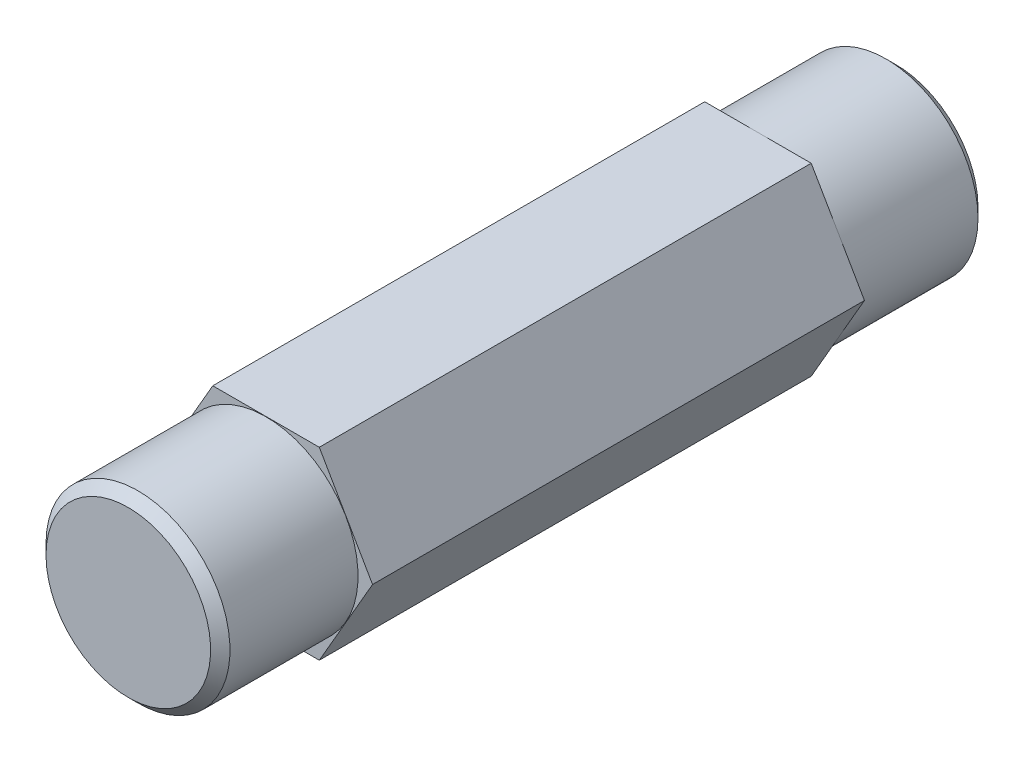
ISO-10303-21;
HEADER;
FILE_DESCRIPTION(('STEP AP214'),'2;1');
FILE_NAME('part.step','',(''),(''),'','','');
FILE_SCHEMA(('AUTOMOTIVE_DESIGN { 1 0 10303 214 1 1 1 1 }'));
ENDSEC;
DATA;
#1=APPLICATION_CONTEXT('core data for automotive mechanical design processes');
#2=APPLICATION_PROTOCOL_DEFINITION('international standard','automotive_design',2000,#1);
#3=PRODUCT_CONTEXT('',#1,'mechanical');
#4=PRODUCT('Part','Part','',(#3));
#5=PRODUCT_RELATED_PRODUCT_CATEGORY('part','',(#4));
#6=PRODUCT_DEFINITION_FORMATION('','',#4);
#7=PRODUCT_DEFINITION_CONTEXT('part definition',#1,'design');
#8=PRODUCT_DEFINITION('design','',#6,#7);
#9=PRODUCT_DEFINITION_SHAPE('','',#8);
#10=(LENGTH_UNIT() NAMED_UNIT(*) SI_UNIT(.MILLI.,.METRE.));
#11=(NAMED_UNIT(*) PLANE_ANGLE_UNIT() SI_UNIT($,.RADIAN.));
#12=(NAMED_UNIT(*) SI_UNIT($,.STERADIAN.) SOLID_ANGLE_UNIT());
#13=UNCERTAINTY_MEASURE_WITH_UNIT(LENGTH_MEASURE(1.E-05),#10,'distance_accuracy_value','');
#14=(GEOMETRIC_REPRESENTATION_CONTEXT(3) GLOBAL_UNCERTAINTY_ASSIGNED_CONTEXT((#13)) GLOBAL_UNIT_ASSIGNED_CONTEXT((#10,
#11,#12)) REPRESENTATION_CONTEXT('',''));
#15=CARTESIAN_POINT('',(0.,0.,0.));
#16=DIRECTION('',(0.,0.,1.));
#17=DIRECTION('',(1.,0.,0.));
#18=AXIS2_PLACEMENT_3D('',#15,#16,#17);
#19=CARTESIAN_POINT('',(0.,0.,19.812));
#20=DIRECTION('',(0.,0.,1.));
#21=DIRECTION('',(1.,0.,0.));
#22=AXIS2_PLACEMENT_3D('',#19,#20,#21);
#23=PLANE('',#22);
#24=CARTESIAN_POINT('',(0.,0.,19.8120000000017));
#25=DIRECTION('',(0.,0.,-1.));
#26=DIRECTION('',(-1.,0.,0.));
#27=AXIS2_PLACEMENT_3D('',#24,#25,#26);
#28=CIRCLE('',#27,4.24980000002506);
#29=CARTESIAN_POINT('',(-4.24980000002506,0.,19.8120000000017));
#30=VERTEX_POINT('',#29);
#31=EDGE_CURVE('E21',#30,#30,#28,.T.);
#32=ORIENTED_EDGE('',*,*,#31,.F.);
#33=EDGE_LOOP('',(#32));
#34=FACE_BOUND('',#33,.T.);
#35=ADVANCED_FACE('F18',(#34),#23,.T.);
#36=CARTESIAN_POINT('',(0.,0.,-19.812));
#37=DIRECTION('',(0.,0.,-1.));
#38=DIRECTION('',(-1.,0.,0.));
#39=AXIS2_PLACEMENT_3D('',#36,#37,#38);
#40=PLANE('',#39);
#41=CARTESIAN_POINT('',(0.,0.,-19.8120000000017));
#42=DIRECTION('',(0.,0.,1.));
#43=DIRECTION('',(1.,0.,0.));
#44=AXIS2_PLACEMENT_3D('',#41,#42,#43);
#45=CIRCLE('',#44,4.24980000002506);
#46=CARTESIAN_POINT('',(4.24980000002506,0.,-19.8120000000017));
#47=VERTEX_POINT('',#46);
#48=EDGE_CURVE('E107',#47,#47,#45,.T.);
#49=ORIENTED_EDGE('',*,*,#48,.F.);
#50=EDGE_LOOP('',(#49));
#51=FACE_BOUND('',#50,.T.);
#52=ADVANCED_FACE('F125',(#51),#40,.T.);
#53=CARTESIAN_POINT('',(0.,0.,19.3120000000135));
#54=DIRECTION('',(0.,0.,-1.));
#55=DIRECTION('',(-1.,0.,0.));
#56=AXIS2_PLACEMENT_3D('',#53,#54,#55);
#57=CONICAL_SURFACE('',#56,4.74980000007008,0.785398163454292);
#58=CARTESIAN_POINT('',(0.,0.,19.312));
#59=DIRECTION('',(0.,0.,-1.));
#60=DIRECTION('',(-1.,0.,0.));
#61=AXIS2_PLACEMENT_3D('',#58,#59,#60);
#62=CIRCLE('',#61,4.7498);
#63=CARTESIAN_POINT('',(-4.7498,0.,19.312));
#64=VERTEX_POINT('',#63);
#65=EDGE_CURVE('E104',#64,#64,#62,.T.);
#66=ORIENTED_EDGE('',*,*,#65,.F.);
#67=EDGE_LOOP('',(#66));
#68=FACE_BOUND('',#67,.T.);
#69=ORIENTED_EDGE('',*,*,#31,.T.);
#70=EDGE_LOOP('',(#69));
#71=FACE_BOUND('',#70,.T.);
#72=ADVANCED_FACE('F122',(#68,#71),#57,.T.);
#73=CARTESIAN_POINT('',(0.,0.,-19.3120000000704));
#74=DIRECTION('',(0.,0.,1.));
#75=DIRECTION('',(1.,0.,0.));
#76=AXIS2_PLACEMENT_3D('',#73,#74,#75);
#77=CONICAL_SURFACE('',#76,4.74979999995639,0.785398163397448);
#78=CARTESIAN_POINT('',(0.,0.,-19.312));
#79=DIRECTION('',(0.,0.,1.));
#80=DIRECTION('',(1.,0.,0.));
#81=AXIS2_PLACEMENT_3D('',#78,#79,#80);
#82=CIRCLE('',#81,4.7498);
#83=CARTESIAN_POINT('',(4.7498,0.,-19.312));
#84=VERTEX_POINT('',#83);
#85=EDGE_CURVE('E101',#84,#84,#82,.T.);
#86=ORIENTED_EDGE('',*,*,#85,.F.);
#87=EDGE_LOOP('',(#86));
#88=FACE_BOUND('',#87,.T.);
#89=ORIENTED_EDGE('',*,*,#48,.T.);
#90=EDGE_LOOP('',(#89));
#91=FACE_BOUND('',#90,.T.);
#92=ADVANCED_FACE('F166',(#88,#91),#77,.T.);
#93=CARTESIAN_POINT('',(0.,0.,19.812));
#94=DIRECTION('',(0.,0.,-1.));
#95=DIRECTION('',(-1.,0.,0.));
#96=AXIS2_PLACEMENT_3D('',#93,#94,#95);
#97=CYLINDRICAL_SURFACE('',#96,4.7498);
#98=CARTESIAN_POINT('',(0.,0.,12.7));
#99=DIRECTION('',(0.,0.,-1.));
#100=DIRECTION('',(-1.,0.,0.));
#101=AXIS2_PLACEMENT_3D('',#98,#99,#100);
#102=CIRCLE('',#101,4.7498);
#103=CARTESIAN_POINT('',(-4.7498,0.,12.7));
#104=VERTEX_POINT('',#103);
#105=EDGE_CURVE('E113',#104,#104,#102,.T.);
#106=ORIENTED_EDGE('',*,*,#105,.F.);
#107=EDGE_LOOP('',(#106));
#108=FACE_BOUND('',#107,.T.);
#109=ORIENTED_EDGE('',*,*,#65,.T.);
#110=EDGE_LOOP('',(#109));
#111=FACE_BOUND('',#110,.T.);
#112=ADVANCED_FACE('F162',(#108,#111),#97,.T.);
#113=CARTESIAN_POINT('',(0.,0.,-19.812));
#114=DIRECTION('',(0.,0.,1.));
#115=DIRECTION('',(1.,0.,0.));
#116=AXIS2_PLACEMENT_3D('',#113,#114,#115);
#117=CYLINDRICAL_SURFACE('',#116,4.7498);
#118=CARTESIAN_POINT('',(0.,0.,-12.7));
#119=DIRECTION('',(0.,0.,1.));
#120=DIRECTION('',(1.,0.,0.));
#121=AXIS2_PLACEMENT_3D('',#118,#119,#120);
#122=CIRCLE('',#121,4.7498);
#123=CARTESIAN_POINT('',(4.7498,0.,-12.7));
#124=VERTEX_POINT('',#123);
#125=EDGE_CURVE('E108',#124,#124,#122,.F.);
#126=ORIENTED_EDGE('',*,*,#125,.T.);
#127=EDGE_LOOP('',(#126));
#128=FACE_BOUND('',#127,.T.);
#129=ORIENTED_EDGE('',*,*,#85,.T.);
#130=EDGE_LOOP('',(#129));
#131=FACE_BOUND('',#130,.T.);
#132=ADVANCED_FACE('F159',(#128,#131),#117,.T.);
#133=CARTESIAN_POINT('',(5.49926131403118,0.,12.7));
#134=DIRECTION('',(-0.866025403784439,-0.5,0.));
#135=DIRECTION('',(0.5,-0.866025403784439,0.));
#136=AXIS2_PLACEMENT_3D('',#133,#134,#135);
#137=PLANE('',#136);
#138=DIRECTION('',(0.,0.,-1.));
#139=VECTOR('',#138,1.);
#140=CARTESIAN_POINT('',(2.74963065701559,4.7625,12.7));
#141=LINE('',#140,#139);
#142=CARTESIAN_POINT('',(2.74963065701559,4.7625,-12.7));
#143=VERTEX_POINT('',#142);
#144=CARTESIAN_POINT('',(2.74963065701559,4.7625,12.7));
#145=VERTEX_POINT('',#144);
#146=EDGE_CURVE('E83',#143,#145,#141,.F.);
#147=ORIENTED_EDGE('',*,*,#146,.T.);
#148=DIRECTION('',(-0.5,0.866025403784439,0.));
#149=VECTOR('',#148,1.);
#150=CARTESIAN_POINT('',(5.49926131403118,0.,12.7));
#151=LINE('',#150,#149);
#152=CARTESIAN_POINT('',(5.49926131403118,0.,12.7));
#153=VERTEX_POINT('',#152);
#154=EDGE_CURVE('E88',#153,#145,#151,.T.);
#155=ORIENTED_EDGE('',*,*,#154,.F.);
#156=DIRECTION('',(0.,0.,1.));
#157=VECTOR('',#156,1.);
#158=CARTESIAN_POINT('',(5.49926131403118,0.,12.7));
#159=LINE('',#158,#157);
#160=CARTESIAN_POINT('',(5.49926131403118,0.,-12.7));
#161=VERTEX_POINT('',#160);
#162=EDGE_CURVE('E74',#153,#161,#159,.F.);
#163=ORIENTED_EDGE('',*,*,#162,.T.);
#164=DIRECTION('',(-0.5,0.866025403784439,0.));
#165=VECTOR('',#164,1.);
#166=CARTESIAN_POINT('',(5.49926131403118,0.,-12.7));
#167=LINE('',#166,#165);
#168=EDGE_CURVE('E111',#161,#143,#167,.T.);
#169=ORIENTED_EDGE('',*,*,#168,.T.);
#170=EDGE_LOOP('',(#147,#155,#163,#169));
#171=FACE_BOUND('',#170,.T.);
#172=ADVANCED_FACE('F92',(#171),#137,.F.);
#173=CARTESIAN_POINT('',(-2.74963065701559,-4.7625,12.7));
#174=DIRECTION('',(0.,1.,0.));
#175=DIRECTION('',(0.,0.,1.));
#176=AXIS2_PLACEMENT_3D('',#173,#174,#175);
#177=PLANE('',#176);
#178=DIRECTION('',(0.,0.,1.));
#179=VECTOR('',#178,1.);
#180=CARTESIAN_POINT('',(2.74963065701559,-4.7625,12.7));
#181=LINE('',#180,#179);
#182=CARTESIAN_POINT('',(2.74963065701559,-4.7625,-12.7));
#183=VERTEX_POINT('',#182);
#184=CARTESIAN_POINT('',(2.74963065701559,-4.7625,12.7));
#185=VERTEX_POINT('',#184);
#186=EDGE_CURVE('E67',#183,#185,#181,.T.);
#187=ORIENTED_EDGE('',*,*,#186,.T.);
#188=DIRECTION('',(1.,0.,0.));
#189=VECTOR('',#188,1.);
#190=CARTESIAN_POINT('',(5.49926131403118,-4.7625,12.7));
#191=LINE('',#190,#189);
#192=CARTESIAN_POINT('',(-2.74963065701559,-4.7625,12.7));
#193=VERTEX_POINT('',#192);
#194=EDGE_CURVE('E90',#193,#185,#191,.T.);
#195=ORIENTED_EDGE('',*,*,#194,.F.);
#196=DIRECTION('',(0.,0.,1.));
#197=VECTOR('',#196,1.);
#198=CARTESIAN_POINT('',(-2.74963065701559,-4.7625,12.7));
#199=LINE('',#198,#197);
#200=CARTESIAN_POINT('',(-2.74963065701559,-4.7625,-12.7));
#201=VERTEX_POINT('',#200);
#202=EDGE_CURVE('E112',#193,#201,#199,.F.);
#203=ORIENTED_EDGE('',*,*,#202,.T.);
#204=DIRECTION('',(1.,0.,0.));
#205=VECTOR('',#204,1.);
#206=CARTESIAN_POINT('',(5.49926131403118,-4.7625,-12.7));
#207=LINE('',#206,#205);
#208=EDGE_CURVE('E250',#201,#183,#207,.T.);
#209=ORIENTED_EDGE('',*,*,#208,.T.);
#210=EDGE_LOOP('',(#187,#195,#203,#209));
#211=FACE_BOUND('',#210,.T.);
#212=ADVANCED_FACE('F154',(#211),#177,.F.);
#213=CARTESIAN_POINT('',(2.74963065701559,-4.7625,12.7));
#214=DIRECTION('',(-0.866025403784439,0.5,0.));
#215=DIRECTION('',(-0.5,-0.866025403784439,0.));
#216=AXIS2_PLACEMENT_3D('',#213,#214,#215);
#217=PLANE('',#216);
#218=ORIENTED_EDGE('',*,*,#162,.F.);
#219=DIRECTION('',(0.5,0.866025403784439,0.));
#220=VECTOR('',#219,1.);
#221=CARTESIAN_POINT('',(2.74963065701559,-4.7625,12.7));
#222=LINE('',#221,#220);
#223=EDGE_CURVE('E77',#185,#153,#222,.T.);
#224=ORIENTED_EDGE('',*,*,#223,.F.);
#225=ORIENTED_EDGE('',*,*,#186,.F.);
#226=DIRECTION('',(0.5,0.866025403784439,0.));
#227=VECTOR('',#226,1.);
#228=CARTESIAN_POINT('',(2.74963065701559,-4.7625,-12.7));
#229=LINE('',#228,#227);
#230=EDGE_CURVE('E79',#183,#161,#229,.T.);
#231=ORIENTED_EDGE('',*,*,#230,.T.);
#232=EDGE_LOOP('',(#218,#224,#225,#231));
#233=FACE_BOUND('',#232,.T.);
#234=ADVANCED_FACE('F76',(#233),#217,.F.);
#235=CARTESIAN_POINT('',(2.74963065701559,4.7625,12.7));
#236=DIRECTION('',(0.,-1.,0.));
#237=DIRECTION('',(0.,0.,-1.));
#238=AXIS2_PLACEMENT_3D('',#235,#236,#237);
#239=PLANE('',#238);
#240=DIRECTION('',(0.,0.,1.));
#241=VECTOR('',#240,1.);
#242=CARTESIAN_POINT('',(-2.74963065701559,4.7625,12.7));
#243=LINE('',#242,#241);
#244=CARTESIAN_POINT('',(-2.74963065701559,4.7625,-12.7));
#245=VERTEX_POINT('',#244);
#246=CARTESIAN_POINT('',(-2.74963065701559,4.7625,12.7));
#247=VERTEX_POINT('',#246);
#248=EDGE_CURVE('E242',#245,#247,#243,.T.);
#249=ORIENTED_EDGE('',*,*,#248,.T.);
#250=DIRECTION('',(1.,0.,0.));
#251=VECTOR('',#250,1.);
#252=CARTESIAN_POINT('',(5.49926131403118,4.7625,12.7));
#253=LINE('',#252,#251);
#254=EDGE_CURVE('E94',#145,#247,#253,.F.);
#255=ORIENTED_EDGE('',*,*,#254,.F.);
#256=ORIENTED_EDGE('',*,*,#146,.F.);
#257=DIRECTION('',(1.,0.,0.));
#258=VECTOR('',#257,1.);
#259=CARTESIAN_POINT('',(5.49926131403118,4.7625,-12.7));
#260=LINE('',#259,#258);
#261=EDGE_CURVE('E244',#143,#245,#260,.F.);
#262=ORIENTED_EDGE('',*,*,#261,.T.);
#263=EDGE_LOOP('',(#249,#255,#256,#262));
#264=FACE_BOUND('',#263,.T.);
#265=ADVANCED_FACE('F147',(#264),#239,.F.);
#266=CARTESIAN_POINT('',(5.49926131403118,0.,12.7));
#267=DIRECTION('',(0.,0.,1.));
#268=DIRECTION('',(1.,0.,0.));
#269=AXIS2_PLACEMENT_3D('',#266,#267,#268);
#270=PLANE('',#269);
#271=ORIENTED_EDGE('',*,*,#105,.T.);
#272=EDGE_LOOP('',(#271));
#273=FACE_BOUND('',#272,.T.);
#274=DIRECTION('',(-0.5,0.866025403784439,0.));
#275=VECTOR('',#274,1.);
#276=CARTESIAN_POINT('',(-5.49926131403119,0.,12.7));
#277=LINE('',#276,#275);
#278=CARTESIAN_POINT('',(-5.49926131403119,0.,12.7));
#279=VERTEX_POINT('',#278);
#280=EDGE_CURVE('E115',#279,#193,#277,.F.);
#281=ORIENTED_EDGE('',*,*,#280,.T.);
#282=ORIENTED_EDGE('',*,*,#194,.T.);
#283=ORIENTED_EDGE('',*,*,#223,.T.);
#284=ORIENTED_EDGE('',*,*,#154,.T.);
#285=ORIENTED_EDGE('',*,*,#254,.T.);
#286=DIRECTION('',(0.5,0.866025403784439,0.));
#287=VECTOR('',#286,1.);
#288=CARTESIAN_POINT('',(-2.74963065701559,4.7625,12.7));
#289=LINE('',#288,#287);
#290=EDGE_CURVE('E246',#247,#279,#289,.F.);
#291=ORIENTED_EDGE('',*,*,#290,.T.);
#292=EDGE_LOOP('',(#281,#282,#283,#284,#285,#291));
#293=FACE_BOUND('',#292,.T.);
#294=ADVANCED_FACE('F87',(#273,#293),#270,.T.);
#295=CARTESIAN_POINT('',(-5.49926131403119,0.,12.7));
#296=DIRECTION('',(0.866025403784439,0.5,0.));
#297=DIRECTION('',(-0.5,0.866025403784439,0.));
#298=AXIS2_PLACEMENT_3D('',#295,#296,#297);
#299=PLANE('',#298);
#300=ORIENTED_EDGE('',*,*,#202,.F.);
#301=ORIENTED_EDGE('',*,*,#280,.F.);
#302=DIRECTION('',(0.,0.,1.));
#303=VECTOR('',#302,1.);
#304=CARTESIAN_POINT('',(-5.49926131403119,0.,12.7));
#305=LINE('',#304,#303);
#306=CARTESIAN_POINT('',(-5.49926131403119,0.,-12.7));
#307=VERTEX_POINT('',#306);
#308=EDGE_CURVE('E27',#279,#307,#305,.F.);
#309=ORIENTED_EDGE('',*,*,#308,.T.);
#310=DIRECTION('',(0.5,-0.866025403784439,0.));
#311=VECTOR('',#310,1.);
#312=CARTESIAN_POINT('',(-5.49926131403119,0.,-12.7));
#313=LINE('',#312,#311);
#314=EDGE_CURVE('E35',#307,#201,#313,.T.);
#315=ORIENTED_EDGE('',*,*,#314,.T.);
#316=EDGE_LOOP('',(#300,#301,#309,#315));
#317=FACE_BOUND('',#316,.T.);
#318=ADVANCED_FACE('F138',(#317),#299,.F.);
#319=CARTESIAN_POINT('',(5.49926131403118,0.,-12.7));
#320=DIRECTION('',(0.,0.,1.));
#321=DIRECTION('',(1.,0.,0.));
#322=AXIS2_PLACEMENT_3D('',#319,#320,#321);
#323=PLANE('',#322);
#324=ORIENTED_EDGE('',*,*,#208,.F.);
#325=ORIENTED_EDGE('',*,*,#314,.F.);
#326=DIRECTION('',(0.5,0.866025403784439,0.));
#327=VECTOR('',#326,1.);
#328=CARTESIAN_POINT('',(-2.74963065701559,4.7625,-12.7));
#329=LINE('',#328,#327);
#330=EDGE_CURVE('E11',#307,#245,#329,.T.);
#331=ORIENTED_EDGE('',*,*,#330,.T.);
#332=ORIENTED_EDGE('',*,*,#261,.F.);
#333=ORIENTED_EDGE('',*,*,#168,.F.);
#334=ORIENTED_EDGE('',*,*,#230,.F.);
#335=EDGE_LOOP('',(#324,#325,#331,#332,#333,#334));
#336=FACE_BOUND('',#335,.T.);
#337=ORIENTED_EDGE('',*,*,#125,.F.);
#338=EDGE_LOOP('',(#337));
#339=FACE_BOUND('',#338,.T.);
#340=ADVANCED_FACE('F132',(#336,#339),#323,.F.);
#341=CARTESIAN_POINT('',(-2.74963065701559,4.7625,12.7));
#342=DIRECTION('',(0.866025403784439,-0.5,0.));
#343=DIRECTION('',(0.5,0.866025403784439,0.));
#344=AXIS2_PLACEMENT_3D('',#341,#342,#343);
#345=PLANE('',#344);
#346=ORIENTED_EDGE('',*,*,#308,.F.);
#347=ORIENTED_EDGE('',*,*,#290,.F.);
#348=ORIENTED_EDGE('',*,*,#248,.F.);
#349=ORIENTED_EDGE('',*,*,#330,.F.);
#350=EDGE_LOOP('',(#346,#347,#348,#349));
#351=FACE_BOUND('',#350,.T.);
#352=ADVANCED_FACE('F130',(#351),#345,.F.);
#353=CLOSED_SHELL('',(#35,#52,#72,#92,#112,#132,#172,#212,#234,#265,#294,#318,#340,#352));
#354=MANIFOLD_SOLID_BREP('B1',#353);
#355=ADVANCED_BREP_SHAPE_REPRESENTATION('',(#18,#354),#14);
#356=SHAPE_DEFINITION_REPRESENTATION(#9,#355);
ENDSEC;
END-ISO-10303-21;
